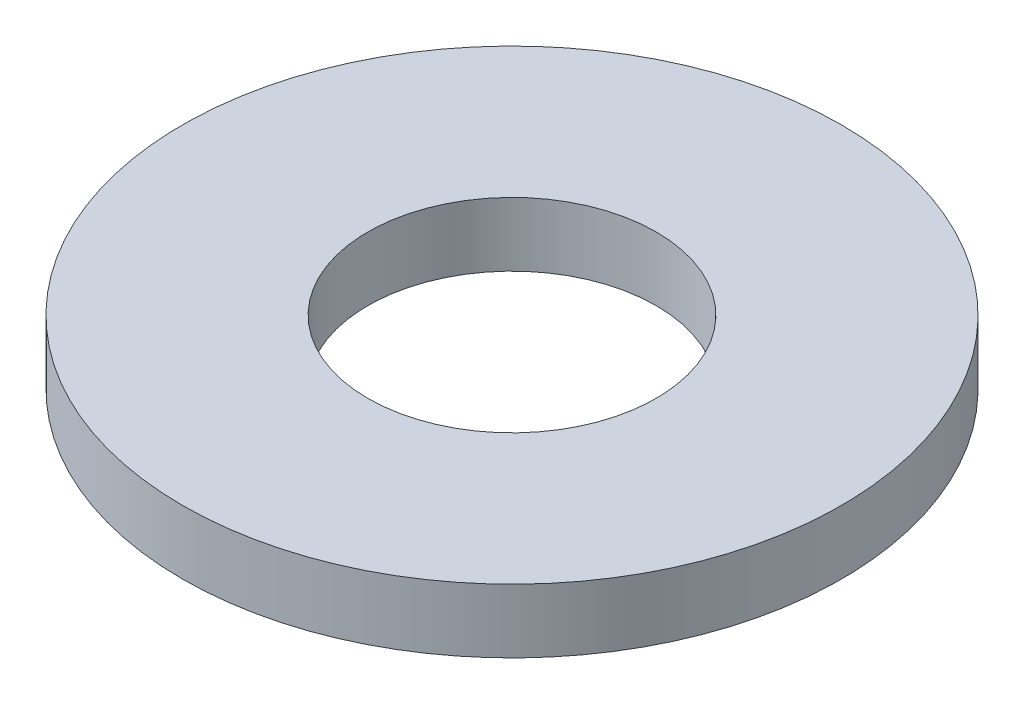
ISO-10303-21;
HEADER;
FILE_DESCRIPTION(('STEP AP214'),'2;1');
FILE_NAME('part.step','',(''),(''),'','','');
FILE_SCHEMA(('AUTOMOTIVE_DESIGN { 1 0 10303 214 1 1 1 1 }'));
ENDSEC;
DATA;
#1=APPLICATION_CONTEXT('core data for automotive mechanical design processes');
#2=APPLICATION_PROTOCOL_DEFINITION('international standard','automotive_design',2000,#1);
#3=PRODUCT_CONTEXT('',#1,'mechanical');
#4=PRODUCT('Part','Part','',(#3));
#5=PRODUCT_RELATED_PRODUCT_CATEGORY('part','',(#4));
#6=PRODUCT_DEFINITION_FORMATION('','',#4);
#7=PRODUCT_DEFINITION_CONTEXT('part definition',#1,'design');
#8=PRODUCT_DEFINITION('design','',#6,#7);
#9=PRODUCT_DEFINITION_SHAPE('','',#8);
#10=(LENGTH_UNIT() NAMED_UNIT(*) SI_UNIT(.MILLI.,.METRE.));
#11=(NAMED_UNIT(*) PLANE_ANGLE_UNIT() SI_UNIT($,.RADIAN.));
#12=(NAMED_UNIT(*) SI_UNIT($,.STERADIAN.) SOLID_ANGLE_UNIT());
#13=UNCERTAINTY_MEASURE_WITH_UNIT(LENGTH_MEASURE(1.E-05),#10,'distance_accuracy_value','');
#14=(GEOMETRIC_REPRESENTATION_CONTEXT(3) GLOBAL_UNCERTAINTY_ASSIGNED_CONTEXT((#13)) GLOBAL_UNIT_ASSIGNED_CONTEXT((#10,
#11,#12)) REPRESENTATION_CONTEXT('',''));
#15=CARTESIAN_POINT('',(0.,0.,0.));
#16=DIRECTION('',(0.,0.,1.));
#17=DIRECTION('',(1.,0.,0.));
#18=AXIS2_PLACEMENT_3D('',#15,#16,#17);
#19=CARTESIAN_POINT('',(0.,-1.5748,0.));
#20=DIRECTION('',(0.,1.,0.));
#21=DIRECTION('',(0.,0.,1.));
#22=AXIS2_PLACEMENT_3D('',#19,#20,#21);
#23=PLANE('',#22);
#24=CARTESIAN_POINT('',(0.,-1.5748,0.));
#25=DIRECTION('',(0.,-1.,0.));
#26=DIRECTION('',(0.,0.,-1.));
#27=AXIS2_PLACEMENT_3D('',#24,#25,#26);
#28=CIRCLE('',#27,8.128);
#29=CARTESIAN_POINT('',(0.,-1.5748,-8.128));
#30=VERTEX_POINT('',#29);
#31=EDGE_CURVE('E26',#30,#30,#28,.F.);
#32=ORIENTED_EDGE('',*,*,#31,.F.);
#33=EDGE_LOOP('',(#32));
#34=FACE_BOUND('',#33,.T.);
#35=CARTESIAN_POINT('',(0.,-1.5748,0.));
#36=DIRECTION('',(0.,-1.,0.));
#37=DIRECTION('',(0.,0.,-1.));
#38=AXIS2_PLACEMENT_3D('',#35,#36,#37);
#39=CIRCLE('',#38,3.556);
#40=CARTESIAN_POINT('',(0.,-1.5748,-3.556));
#41=VERTEX_POINT('',#40);
#42=EDGE_CURVE('E17',#41,#41,#39,.F.);
#43=ORIENTED_EDGE('',*,*,#42,.T.);
#44=EDGE_LOOP('',(#43));
#45=FACE_BOUND('',#44,.T.);
#46=ADVANCED_FACE('F14',(#34,#45),#23,.F.);
#47=CARTESIAN_POINT('',(0.,-1.5748,0.));
#48=DIRECTION('',(0.,-1.,0.));
#49=DIRECTION('',(0.,0.,-1.));
#50=AXIS2_PLACEMENT_3D('',#47,#48,#49);
#51=CYLINDRICAL_SURFACE('',#50,3.556);
#52=CARTESIAN_POINT('',(0.,0.,0.));
#53=DIRECTION('',(0.,-1.,0.));
#54=DIRECTION('',(0.,0.,-1.));
#55=AXIS2_PLACEMENT_3D('',#52,#53,#54);
#56=CIRCLE('',#55,3.556);
#57=CARTESIAN_POINT('',(0.,0.,-3.556));
#58=VERTEX_POINT('',#57);
#59=EDGE_CURVE('E21',#58,#58,#56,.T.);
#60=ORIENTED_EDGE('',*,*,#59,.F.);
#61=EDGE_LOOP('',(#60));
#62=FACE_BOUND('',#61,.T.);
#63=ORIENTED_EDGE('',*,*,#42,.F.);
#64=EDGE_LOOP('',(#63));
#65=FACE_BOUND('',#64,.T.);
#66=ADVANCED_FACE('F35',(#62,#65),#51,.F.);
#67=CARTESIAN_POINT('',(0.,-1.5748,0.));
#68=DIRECTION('',(0.,-1.,0.));
#69=DIRECTION('',(0.,0.,-1.));
#70=AXIS2_PLACEMENT_3D('',#67,#68,#69);
#71=CYLINDRICAL_SURFACE('',#70,8.128);
#72=CARTESIAN_POINT('',(0.,0.,0.));
#73=DIRECTION('',(0.,-1.,0.));
#74=DIRECTION('',(0.,0.,-1.));
#75=AXIS2_PLACEMENT_3D('',#72,#73,#74);
#76=CIRCLE('',#75,8.128);
#77=CARTESIAN_POINT('',(0.,0.,-8.128));
#78=VERTEX_POINT('',#77);
#79=EDGE_CURVE('E10',#78,#78,#76,.F.);
#80=ORIENTED_EDGE('',*,*,#79,.F.);
#81=EDGE_LOOP('',(#80));
#82=FACE_BOUND('',#81,.T.);
#83=ORIENTED_EDGE('',*,*,#31,.T.);
#84=EDGE_LOOP('',(#83));
#85=FACE_BOUND('',#84,.T.);
#86=ADVANCED_FACE('F37',(#82,#85),#71,.T.);
#87=CARTESIAN_POINT('',(0.,0.,0.));
#88=DIRECTION('',(0.,1.,0.));
#89=DIRECTION('',(0.,0.,1.));
#90=AXIS2_PLACEMENT_3D('',#87,#88,#89);
#91=PLANE('',#90);
#92=ORIENTED_EDGE('',*,*,#79,.T.);
#93=EDGE_LOOP('',(#92));
#94=FACE_BOUND('',#93,.T.);
#95=ORIENTED_EDGE('',*,*,#59,.T.);
#96=EDGE_LOOP('',(#95));
#97=FACE_BOUND('',#96,.T.);
#98=ADVANCED_FACE('F44',(#94,#97),#91,.T.);
#99=CLOSED_SHELL('',(#46,#66,#86,#98));
#100=MANIFOLD_SOLID_BREP('B1',#99);
#101=ADVANCED_BREP_SHAPE_REPRESENTATION('',(#18,#100),#14);
#102=SHAPE_DEFINITION_REPRESENTATION(#9,#101);
ENDSEC;
END-ISO-10303-21;
